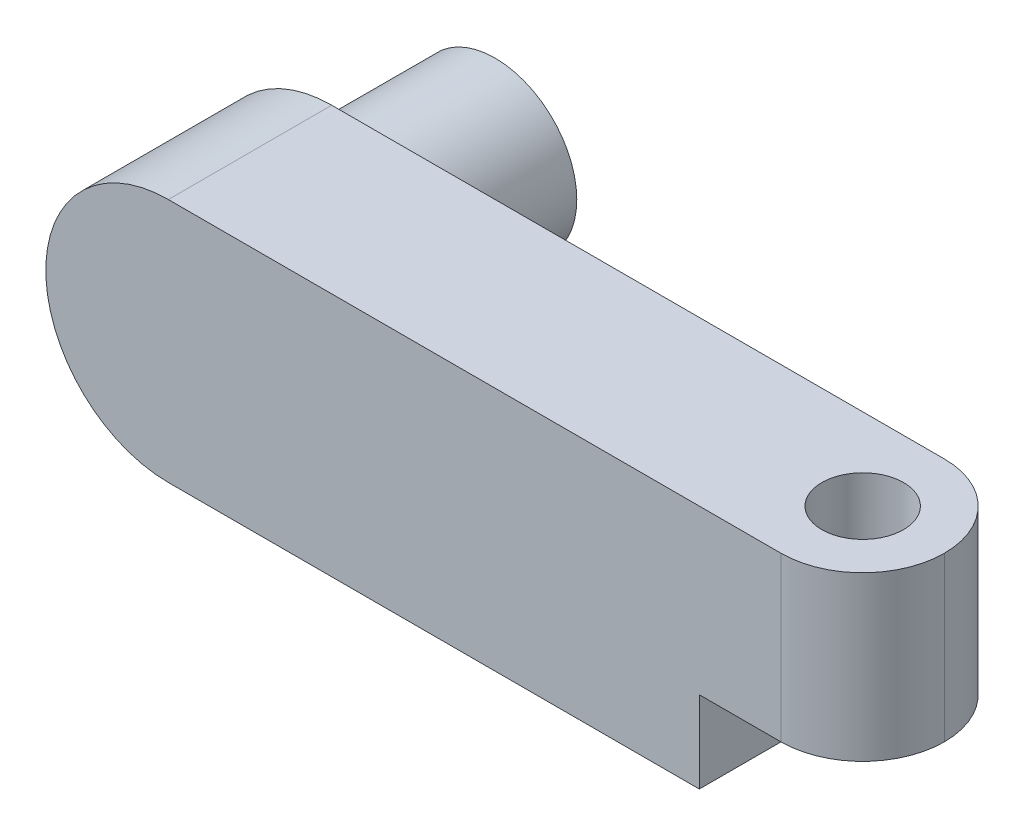
ISO-10303-21;
HEADER;
FILE_DESCRIPTION(('STEP AP214'),'2;1');
FILE_NAME('part.step','',(''),(''),'','','');
FILE_SCHEMA(('AUTOMOTIVE_DESIGN { 1 0 10303 214 1 1 1 1 }'));
ENDSEC;
DATA;
#1=APPLICATION_CONTEXT('core data for automotive mechanical design processes');
#2=APPLICATION_PROTOCOL_DEFINITION('international standard','automotive_design',2000,#1);
#3=PRODUCT_CONTEXT('',#1,'mechanical');
#4=PRODUCT('Part','Part','',(#3));
#5=PRODUCT_RELATED_PRODUCT_CATEGORY('part','',(#4));
#6=PRODUCT_DEFINITION_FORMATION('','',#4);
#7=PRODUCT_DEFINITION_CONTEXT('part definition',#1,'design');
#8=PRODUCT_DEFINITION('design','',#6,#7);
#9=PRODUCT_DEFINITION_SHAPE('','',#8);
#10=(LENGTH_UNIT() NAMED_UNIT(*) SI_UNIT(.MILLI.,.METRE.));
#11=(NAMED_UNIT(*) PLANE_ANGLE_UNIT() SI_UNIT($,.RADIAN.));
#12=(NAMED_UNIT(*) SI_UNIT($,.STERADIAN.) SOLID_ANGLE_UNIT());
#13=UNCERTAINTY_MEASURE_WITH_UNIT(LENGTH_MEASURE(1.E-05),#10,'distance_accuracy_value','');
#14=(GEOMETRIC_REPRESENTATION_CONTEXT(3) GLOBAL_UNCERTAINTY_ASSIGNED_CONTEXT((#13)) GLOBAL_UNIT_ASSIGNED_CONTEXT((#10,
#11,#12)) REPRESENTATION_CONTEXT('',''));
#15=CARTESIAN_POINT('',(0.,0.,0.));
#16=DIRECTION('',(0.,0.,1.));
#17=DIRECTION('',(1.,0.,0.));
#18=AXIS2_PLACEMENT_3D('',#15,#16,#17);
#19=CARTESIAN_POINT('',(0.,0.,-20.));
#20=DIRECTION('',(0.,0.,1.));
#21=DIRECTION('',(1.,0.,0.));
#22=AXIS2_PLACEMENT_3D('',#19,#20,#21);
#23=CYLINDRICAL_SURFACE('',#22,15.);
#24=CARTESIAN_POINT('',(0.,0.,0.));
#25=DIRECTION('',(0.,0.,1.));
#26=DIRECTION('',(1.,0.,0.));
#27=AXIS2_PLACEMENT_3D('',#24,#25,#26);
#28=CIRCLE('',#27,15.);
#29=CARTESIAN_POINT('',(0.,15.,0.));
#30=VERTEX_POINT('',#29);
#31=CARTESIAN_POINT('',(0.,-15.,0.));
#32=VERTEX_POINT('',#31);
#33=EDGE_CURVE('E129',#30,#32,#28,.T.);
#34=ORIENTED_EDGE('',*,*,#33,.F.);
#35=DIRECTION('',(0.,0.,1.));
#36=VECTOR('',#35,1.);
#37=CARTESIAN_POINT('',(0.,15.,-20.));
#38=LINE('',#37,#36);
#39=CARTESIAN_POINT('',(0.,15.,-20.));
#40=VERTEX_POINT('',#39);
#41=EDGE_CURVE('E114',#40,#30,#38,.T.);
#42=ORIENTED_EDGE('',*,*,#41,.F.);
#43=CARTESIAN_POINT('',(0.,0.,-20.));
#44=DIRECTION('',(0.,0.,1.));
#45=DIRECTION('',(1.,0.,0.));
#46=AXIS2_PLACEMENT_3D('',#43,#44,#45);
#47=CIRCLE('',#46,15.);
#48=CARTESIAN_POINT('',(0.,-15.,-20.));
#49=VERTEX_POINT('',#48);
#50=EDGE_CURVE('E110',#40,#49,#47,.T.);
#51=ORIENTED_EDGE('',*,*,#50,.T.);
#52=DIRECTION('',(0.,0.,1.));
#53=VECTOR('',#52,1.);
#54=CARTESIAN_POINT('',(0.,-15.,-20.));
#55=LINE('',#54,#53);
#56=EDGE_CURVE('E94',#49,#32,#55,.T.);
#57=ORIENTED_EDGE('',*,*,#56,.T.);
#58=EDGE_LOOP('',(#34,#42,#51,#57));
#59=FACE_BOUND('',#58,.T.);
#60=ADVANCED_FACE('F34',(#59),#23,.T.);
#61=CARTESIAN_POINT('',(0.,15.,-20.));
#62=DIRECTION('',(0.,-1.,0.));
#63=DIRECTION('',(0.,0.,-1.));
#64=AXIS2_PLACEMENT_3D('',#61,#62,#63);
#65=PLANE('',#64);
#66=CARTESIAN_POINT('',(75.,15.,-10.));
#67=DIRECTION('',(0.,1.,0.));
#68=DIRECTION('',(0.,0.,1.));
#69=AXIS2_PLACEMENT_3D('',#66,#67,#68);
#70=CIRCLE('',#69,5.);
#71=CARTESIAN_POINT('',(75.,15.,-5.));
#72=VERTEX_POINT('',#71);
#73=EDGE_CURVE('E153',#72,#72,#70,.T.);
#74=ORIENTED_EDGE('',*,*,#73,.F.);
#75=EDGE_LOOP('',(#74));
#76=FACE_BOUND('',#75,.T.);
#77=DIRECTION('',(1.,0.,0.));
#78=VECTOR('',#77,1.);
#79=CARTESIAN_POINT('',(0.,15.,0.));
#80=LINE('',#79,#78);
#81=CARTESIAN_POINT('',(75.,15.,0.));
#82=VERTEX_POINT('',#81);
#83=EDGE_CURVE('E116',#30,#82,#80,.T.);
#84=ORIENTED_EDGE('',*,*,#83,.T.);
#85=CARTESIAN_POINT('',(75.,15.,-10.));
#86=DIRECTION('',(0.,-1.,0.));
#87=DIRECTION('',(0.,0.,-1.));
#88=AXIS2_PLACEMENT_3D('',#85,#86,#87);
#89=CIRCLE('',#88,10.);
#90=CARTESIAN_POINT('',(85.,15.,-10.));
#91=VERTEX_POINT('',#90);
#92=EDGE_CURVE('E147',#82,#91,#89,.F.);
#93=ORIENTED_EDGE('',*,*,#92,.T.);
#94=CARTESIAN_POINT('',(75.,15.,-10.));
#95=DIRECTION('',(0.,-1.,0.));
#96=DIRECTION('',(0.,0.,-1.));
#97=AXIS2_PLACEMENT_3D('',#94,#95,#96);
#98=CIRCLE('',#97,10.);
#99=CARTESIAN_POINT('',(75.,15.,-20.));
#100=VERTEX_POINT('',#99);
#101=EDGE_CURVE('E145',#91,#100,#98,.F.);
#102=ORIENTED_EDGE('',*,*,#101,.T.);
#103=DIRECTION('',(1.,0.,0.));
#104=VECTOR('',#103,1.);
#105=CARTESIAN_POINT('',(0.,15.,-20.));
#106=LINE('',#105,#104);
#107=EDGE_CURVE('E105',#40,#100,#106,.T.);
#108=ORIENTED_EDGE('',*,*,#107,.F.);
#109=ORIENTED_EDGE('',*,*,#41,.T.);
#110=EDGE_LOOP('',(#84,#93,#102,#108,#109));
#111=FACE_BOUND('',#110,.T.);
#112=ADVANCED_FACE('F187',(#76,#111),#65,.F.);
#113=CARTESIAN_POINT('',(65.,-5.,-20.));
#114=DIRECTION('',(0.,-1.,0.));
#115=DIRECTION('',(0.,0.,-1.));
#116=AXIS2_PLACEMENT_3D('',#113,#114,#115);
#117=PLANE('',#116);
#118=CARTESIAN_POINT('',(75.,-5.,-10.));
#119=DIRECTION('',(0.,-1.,0.));
#120=DIRECTION('',(0.,0.,-1.));
#121=AXIS2_PLACEMENT_3D('',#118,#119,#120);
#122=CIRCLE('',#121,5.);
#123=CARTESIAN_POINT('',(75.,-5.,-15.));
#124=VERTEX_POINT('',#123);
#125=EDGE_CURVE('E122',#124,#124,#122,.F.);
#126=ORIENTED_EDGE('',*,*,#125,.T.);
#127=EDGE_LOOP('',(#126));
#128=FACE_BOUND('',#127,.T.);
#129=CARTESIAN_POINT('',(75.,-5.,-10.));
#130=DIRECTION('',(0.,-1.,0.));
#131=DIRECTION('',(0.,0.,-1.));
#132=AXIS2_PLACEMENT_3D('',#129,#130,#131);
#133=CIRCLE('',#132,10.);
#134=CARTESIAN_POINT('',(75.,-5.,-20.));
#135=VERTEX_POINT('',#134);
#136=CARTESIAN_POINT('',(85.,-5.,-10.));
#137=VERTEX_POINT('',#136);
#138=EDGE_CURVE('E49',#135,#137,#133,.T.);
#139=ORIENTED_EDGE('',*,*,#138,.T.);
#140=CARTESIAN_POINT('',(75.,-5.,-10.));
#141=DIRECTION('',(0.,-1.,0.));
#142=DIRECTION('',(0.,0.,-1.));
#143=AXIS2_PLACEMENT_3D('',#140,#141,#142);
#144=CIRCLE('',#143,10.);
#145=CARTESIAN_POINT('',(75.,-5.,0.));
#146=VERTEX_POINT('',#145);
#147=EDGE_CURVE('E150',#137,#146,#144,.T.);
#148=ORIENTED_EDGE('',*,*,#147,.T.);
#149=DIRECTION('',(1.,0.,0.));
#150=VECTOR('',#149,1.);
#151=CARTESIAN_POINT('',(65.,-5.,0.));
#152=LINE('',#151,#150);
#153=CARTESIAN_POINT('',(65.,-5.,0.));
#154=VERTEX_POINT('',#153);
#155=EDGE_CURVE('E119',#154,#146,#152,.T.);
#156=ORIENTED_EDGE('',*,*,#155,.F.);
#157=DIRECTION('',(0.,0.,1.));
#158=VECTOR('',#157,1.);
#159=CARTESIAN_POINT('',(65.,-5.,-20.));
#160=LINE('',#159,#158);
#161=CARTESIAN_POINT('',(65.,-5.,-20.));
#162=VERTEX_POINT('',#161);
#163=EDGE_CURVE('E140',#162,#154,#160,.T.);
#164=ORIENTED_EDGE('',*,*,#163,.F.);
#165=DIRECTION('',(1.,0.,0.));
#166=VECTOR('',#165,1.);
#167=CARTESIAN_POINT('',(65.,-5.,-20.));
#168=LINE('',#167,#166);
#169=EDGE_CURVE('E126',#162,#135,#168,.T.);
#170=ORIENTED_EDGE('',*,*,#169,.T.);
#171=EDGE_LOOP('',(#139,#148,#156,#164,#170));
#172=FACE_BOUND('',#171,.T.);
#173=ADVANCED_FACE('F192',(#128,#172),#117,.T.);
#174=CARTESIAN_POINT('',(65.,-15.,-20.));
#175=DIRECTION('',(1.,0.,0.));
#176=DIRECTION('',(0.,0.,-1.));
#177=AXIS2_PLACEMENT_3D('',#174,#175,#176);
#178=PLANE('',#177);
#179=DIRECTION('',(0.,1.,0.));
#180=VECTOR('',#179,1.);
#181=CARTESIAN_POINT('',(65.,-15.,0.));
#182=LINE('',#181,#180);
#183=CARTESIAN_POINT('',(65.,-15.,0.));
#184=VERTEX_POINT('',#183);
#185=EDGE_CURVE('E133',#184,#154,#182,.T.);
#186=ORIENTED_EDGE('',*,*,#185,.F.);
#187=DIRECTION('',(0.,0.,1.));
#188=VECTOR('',#187,1.);
#189=CARTESIAN_POINT('',(65.,-15.,-20.));
#190=LINE('',#189,#188);
#191=CARTESIAN_POINT('',(65.,-15.,-20.));
#192=VERTEX_POINT('',#191);
#193=EDGE_CURVE('E104',#192,#184,#190,.T.);
#194=ORIENTED_EDGE('',*,*,#193,.F.);
#195=DIRECTION('',(0.,1.,0.));
#196=VECTOR('',#195,1.);
#197=CARTESIAN_POINT('',(65.,-15.,-20.));
#198=LINE('',#197,#196);
#199=EDGE_CURVE('E112',#192,#162,#198,.T.);
#200=ORIENTED_EDGE('',*,*,#199,.T.);
#201=ORIENTED_EDGE('',*,*,#163,.T.);
#202=EDGE_LOOP('',(#186,#194,#200,#201));
#203=FACE_BOUND('',#202,.T.);
#204=ADVANCED_FACE('F183',(#203),#178,.T.);
#205=CARTESIAN_POINT('',(0.,-15.,-20.));
#206=DIRECTION('',(0.,-1.,0.));
#207=DIRECTION('',(0.,0.,-1.));
#208=AXIS2_PLACEMENT_3D('',#205,#206,#207);
#209=PLANE('',#208);
#210=DIRECTION('',(1.,0.,0.));
#211=VECTOR('',#210,1.);
#212=CARTESIAN_POINT('',(0.,-15.,0.));
#213=LINE('',#212,#211);
#214=EDGE_CURVE('E99',#32,#184,#213,.T.);
#215=ORIENTED_EDGE('',*,*,#214,.F.);
#216=ORIENTED_EDGE('',*,*,#56,.F.);
#217=DIRECTION('',(1.,0.,0.));
#218=VECTOR('',#217,1.);
#219=CARTESIAN_POINT('',(0.,-15.,-20.));
#220=LINE('',#219,#218);
#221=EDGE_CURVE('E97',#49,#192,#220,.T.);
#222=ORIENTED_EDGE('',*,*,#221,.T.);
#223=ORIENTED_EDGE('',*,*,#193,.T.);
#224=EDGE_LOOP('',(#215,#216,#222,#223));
#225=FACE_BOUND('',#224,.T.);
#226=ADVANCED_FACE('F96',(#225),#209,.T.);
#227=CARTESIAN_POINT('',(0.,0.,-20.));
#228=DIRECTION('',(0.,0.,1.));
#229=DIRECTION('',(1.,0.,0.));
#230=AXIS2_PLACEMENT_3D('',#227,#228,#229);
#231=PLANE('',#230);
#232=CARTESIAN_POINT('',(0.,0.,-20.));
#233=DIRECTION('',(0.,0.,1.));
#234=DIRECTION('',(1.,0.,0.));
#235=AXIS2_PLACEMENT_3D('',#232,#233,#234);
#236=CIRCLE('',#235,10.);
#237=CARTESIAN_POINT('',(10.,0.,-20.));
#238=VERTEX_POINT('',#237);
#239=EDGE_CURVE('E11',#238,#238,#236,.F.);
#240=ORIENTED_EDGE('',*,*,#239,.F.);
#241=EDGE_LOOP('',(#240));
#242=FACE_BOUND('',#241,.T.);
#243=ORIENTED_EDGE('',*,*,#107,.T.);
#244=DIRECTION('',(0.,1.,0.));
#245=VECTOR('',#244,1.);
#246=CARTESIAN_POINT('',(75.,-5.,-20.));
#247=LINE('',#246,#245);
#248=EDGE_CURVE('E42',#100,#135,#247,.F.);
#249=ORIENTED_EDGE('',*,*,#248,.T.);
#250=ORIENTED_EDGE('',*,*,#169,.F.);
#251=ORIENTED_EDGE('',*,*,#199,.F.);
#252=ORIENTED_EDGE('',*,*,#221,.F.);
#253=ORIENTED_EDGE('',*,*,#50,.F.);
#254=EDGE_LOOP('',(#243,#249,#250,#251,#252,#253));
#255=FACE_BOUND('',#254,.T.);
#256=ADVANCED_FACE('F109',(#242,#255),#231,.F.);
#257=CARTESIAN_POINT('',(0.,0.,0.));
#258=DIRECTION('',(0.,0.,1.));
#259=DIRECTION('',(1.,0.,0.));
#260=AXIS2_PLACEMENT_3D('',#257,#258,#259);
#261=PLANE('',#260);
#262=ORIENTED_EDGE('',*,*,#155,.T.);
#263=DIRECTION('',(0.,1.,0.));
#264=VECTOR('',#263,1.);
#265=CARTESIAN_POINT('',(75.,0.,0.));
#266=LINE('',#265,#264);
#267=EDGE_CURVE('E139',#146,#82,#266,.T.);
#268=ORIENTED_EDGE('',*,*,#267,.T.);
#269=ORIENTED_EDGE('',*,*,#83,.F.);
#270=ORIENTED_EDGE('',*,*,#33,.T.);
#271=ORIENTED_EDGE('',*,*,#214,.T.);
#272=ORIENTED_EDGE('',*,*,#185,.T.);
#273=EDGE_LOOP('',(#262,#268,#269,#270,#271,#272));
#274=FACE_BOUND('',#273,.T.);
#275=ADVANCED_FACE('F175',(#274),#261,.T.);
#276=CARTESIAN_POINT('',(75.,-5.,-10.));
#277=DIRECTION('',(0.,-1.,0.));
#278=DIRECTION('',(0.,0.,-1.));
#279=AXIS2_PLACEMENT_3D('',#276,#277,#278);
#280=CYLINDRICAL_SURFACE('',#279,10.);
#281=DIRECTION('',(0.,1.,0.));
#282=VECTOR('',#281,1.);
#283=CARTESIAN_POINT('',(85.,15.,-10.));
#284=LINE('',#283,#282);
#285=EDGE_CURVE('E131',#137,#91,#284,.T.);
#286=ORIENTED_EDGE('',*,*,#285,.F.);
#287=ORIENTED_EDGE('',*,*,#138,.F.);
#288=ORIENTED_EDGE('',*,*,#248,.F.);
#289=ORIENTED_EDGE('',*,*,#101,.F.);
#290=EDGE_LOOP('',(#286,#287,#288,#289));
#291=FACE_BOUND('',#290,.T.);
#292=ADVANCED_FACE('F36',(#291),#280,.T.);
#293=CARTESIAN_POINT('',(75.,0.,-10.));
#294=DIRECTION('',(0.,1.,0.));
#295=DIRECTION('',(0.,0.,1.));
#296=AXIS2_PLACEMENT_3D('',#293,#294,#295);
#297=CYLINDRICAL_SURFACE('',#296,10.);
#298=ORIENTED_EDGE('',*,*,#147,.F.);
#299=ORIENTED_EDGE('',*,*,#285,.T.);
#300=ORIENTED_EDGE('',*,*,#92,.F.);
#301=ORIENTED_EDGE('',*,*,#267,.F.);
#302=EDGE_LOOP('',(#298,#299,#300,#301));
#303=FACE_BOUND('',#302,.T.);
#304=ADVANCED_FACE('F196',(#303),#297,.T.);
#305=CARTESIAN_POINT('',(75.,-15.001,-10.));
#306=DIRECTION('',(0.,1.,0.));
#307=DIRECTION('',(0.,0.,1.));
#308=AXIS2_PLACEMENT_3D('',#305,#306,#307);
#309=CYLINDRICAL_SURFACE('',#308,5.);
#310=ORIENTED_EDGE('',*,*,#125,.F.);
#311=EDGE_LOOP('',(#310));
#312=FACE_BOUND('',#311,.T.);
#313=ORIENTED_EDGE('',*,*,#73,.T.);
#314=EDGE_LOOP('',(#313));
#315=FACE_BOUND('',#314,.T.);
#316=ADVANCED_FACE('F170',(#312,#315),#309,.F.);
#317=CARTESIAN_POINT('',(0.,0.,-40.));
#318=DIRECTION('',(0.,0.,1.));
#319=DIRECTION('',(1.,0.,0.));
#320=AXIS2_PLACEMENT_3D('',#317,#318,#319);
#321=CYLINDRICAL_SURFACE('',#320,10.);
#322=CARTESIAN_POINT('',(0.,0.,-40.));
#323=DIRECTION('',(0.,0.,-1.));
#324=DIRECTION('',(-1.,0.,0.));
#325=AXIS2_PLACEMENT_3D('',#322,#323,#324);
#326=CIRCLE('',#325,10.);
#327=CARTESIAN_POINT('',(-10.,0.,-40.));
#328=VERTEX_POINT('',#327);
#329=EDGE_CURVE('E160',#328,#328,#326,.T.);
#330=ORIENTED_EDGE('',*,*,#329,.F.);
#331=EDGE_LOOP('',(#330));
#332=FACE_BOUND('',#331,.T.);
#333=ORIENTED_EDGE('',*,*,#239,.T.);
#334=EDGE_LOOP('',(#333));
#335=FACE_BOUND('',#334,.T.);
#336=ADVANCED_FACE('F167',(#332,#335),#321,.T.);
#337=CARTESIAN_POINT('',(0.,0.,-40.));
#338=DIRECTION('',(0.,0.,-1.));
#339=DIRECTION('',(-1.,0.,0.));
#340=AXIS2_PLACEMENT_3D('',#337,#338,#339);
#341=PLANE('',#340);
#342=ORIENTED_EDGE('',*,*,#329,.T.);
#343=EDGE_LOOP('',(#342));
#344=FACE_BOUND('',#343,.T.);
#345=ADVANCED_FACE('F165',(#344),#341,.T.);
#346=CLOSED_SHELL('',(#60,#112,#173,#204,#226,#256,#275,#292,#304,#316,#336,#345));
#347=MANIFOLD_SOLID_BREP('B2',#346);
#348=ADVANCED_BREP_SHAPE_REPRESENTATION('',(#18,#347),#14);
#349=SHAPE_DEFINITION_REPRESENTATION(#9,#348);
ENDSEC;
END-ISO-10303-21;
